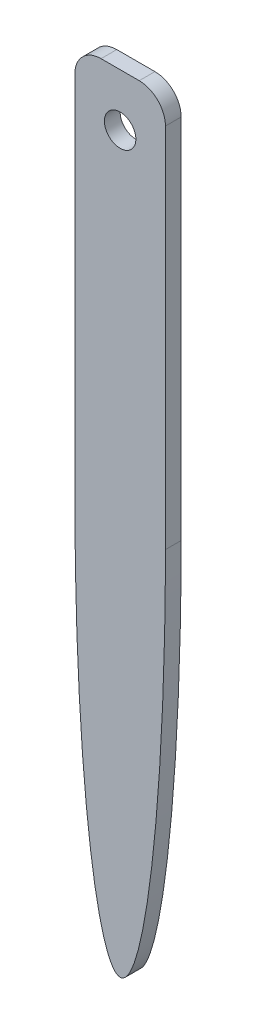
ISO-10303-21;
HEADER;
FILE_DESCRIPTION(('STEP AP214'),'2;1');
FILE_NAME('part.step','',(''),(''),'','','');
FILE_SCHEMA(('AUTOMOTIVE_DESIGN { 1 0 10303 214 1 1 1 1 }'));
ENDSEC;
DATA;
#1=APPLICATION_CONTEXT('core data for automotive mechanical design processes');
#2=APPLICATION_PROTOCOL_DEFINITION('international standard','automotive_design',2000,#1);
#3=PRODUCT_CONTEXT('',#1,'mechanical');
#4=PRODUCT('Part','Part','',(#3));
#5=PRODUCT_RELATED_PRODUCT_CATEGORY('part','',(#4));
#6=PRODUCT_DEFINITION_FORMATION('','',#4);
#7=PRODUCT_DEFINITION_CONTEXT('part definition',#1,'design');
#8=PRODUCT_DEFINITION('design','',#6,#7);
#9=PRODUCT_DEFINITION_SHAPE('','',#8);
#10=(LENGTH_UNIT() NAMED_UNIT(*) SI_UNIT(.MILLI.,.METRE.));
#11=(NAMED_UNIT(*) PLANE_ANGLE_UNIT() SI_UNIT($,.RADIAN.));
#12=(NAMED_UNIT(*) SI_UNIT($,.STERADIAN.) SOLID_ANGLE_UNIT());
#13=UNCERTAINTY_MEASURE_WITH_UNIT(LENGTH_MEASURE(1.E-05),#10,'distance_accuracy_value','');
#14=(GEOMETRIC_REPRESENTATION_CONTEXT(3) GLOBAL_UNCERTAINTY_ASSIGNED_CONTEXT((#13)) GLOBAL_UNIT_ASSIGNED_CONTEXT((#10,
#11,#12)) REPRESENTATION_CONTEXT('',''));
#15=CARTESIAN_POINT('',(0.,0.,0.));
#16=DIRECTION('',(0.,0.,1.));
#17=DIRECTION('',(1.,0.,0.));
#18=AXIS2_PLACEMENT_3D('',#15,#16,#17);
#19=CARTESIAN_POINT('',(0.,0.,3.));
#20=DIRECTION('',(0.,0.,1.));
#21=DIRECTION('',(1.,0.,0.));
#22=AXIS2_PLACEMENT_3D('',#19,#20,#21);
#23=PLANE('',#22);
#24=CARTESIAN_POINT('',(3.64166496588619,70.,3.));
#25=DIRECTION('',(0.,0.,1.));
#26=DIRECTION('',(-1.,0.,0.));
#27=AXIS2_PLACEMENT_3D('',#24,#25,#26);
#28=CIRCLE('',#27,5.);
#29=CARTESIAN_POINT('',(8.64166496588619,70.,3.));
#30=VERTEX_POINT('',#29);
#31=CARTESIAN_POINT('',(3.64166496588619,75.,3.));
#32=VERTEX_POINT('',#31);
#33=EDGE_CURVE('E181',#30,#32,#28,.T.);
#34=ORIENTED_EDGE('',*,*,#33,.T.);
#35=DIRECTION('',(-1.,0.,0.));
#36=VECTOR('',#35,1.);
#37=CARTESIAN_POINT('',(-3.64166496588621,75.,3.));
#38=LINE('',#37,#36);
#39=CARTESIAN_POINT('',(-3.64166496588621,75.,3.));
#40=VERTEX_POINT('',#39);
#41=EDGE_CURVE('E100',#32,#40,#38,.T.);
#42=ORIENTED_EDGE('',*,*,#41,.T.);
#43=CARTESIAN_POINT('',(-3.64166496588621,70.,3.));
#44=DIRECTION('',(0.,0.,1.));
#45=DIRECTION('',(1.,0.,0.));
#46=AXIS2_PLACEMENT_3D('',#43,#44,#45);
#47=CIRCLE('',#46,5.);
#48=CARTESIAN_POINT('',(-8.64166496588621,70.,3.));
#49=VERTEX_POINT('',#48);
#50=EDGE_CURVE('E113',#40,#49,#47,.T.);
#51=ORIENTED_EDGE('',*,*,#50,.T.);
#52=DIRECTION('',(0.,-1.,0.));
#53=VECTOR('',#52,1.);
#54=CARTESIAN_POINT('',(-8.64166496588621,70.,3.));
#55=LINE('',#54,#53);
#56=CARTESIAN_POINT('',(-8.6416649658862,0.,3.));
#57=VERTEX_POINT('',#56);
#58=EDGE_CURVE('E107',#49,#57,#55,.T.);
#59=ORIENTED_EDGE('',*,*,#58,.T.);
#60=CARTESIAN_POINT('',(0.,0.,3.));
#61=DIRECTION('',(0.,0.,1.));
#62=DIRECTION('',(0.,-1.,0.));
#63=AXIS2_PLACEMENT_3D('',#60,#61,#62);
#64=ELLIPSE('',#63,75.,8.6416649658862);
#65=CARTESIAN_POINT('',(8.6416649658862,0.,3.));
#66=VERTEX_POINT('',#65);
#67=EDGE_CURVE('E111',#57,#66,#64,.T.);
#68=ORIENTED_EDGE('',*,*,#67,.T.);
#69=DIRECTION('',(0.,1.,0.));
#70=VECTOR('',#69,1.);
#71=CARTESIAN_POINT('',(8.64166496588619,70.,3.));
#72=LINE('',#71,#70);
#73=EDGE_CURVE('E63',#66,#30,#72,.T.);
#74=ORIENTED_EDGE('',*,*,#73,.T.);
#75=EDGE_LOOP('',(#34,#42,#51,#59,#68,#74));
#76=FACE_BOUND('',#75,.T.);
#77=CARTESIAN_POINT('',(0.,65.,3.));
#78=DIRECTION('',(0.,0.,1.));
#79=DIRECTION('',(1.,0.,0.));
#80=AXIS2_PLACEMENT_3D('',#77,#78,#79);
#81=CIRCLE('',#80,3.);
#82=CARTESIAN_POINT('',(3.,65.,3.));
#83=VERTEX_POINT('',#82);
#84=EDGE_CURVE('E170',#83,#83,#81,.T.);
#85=ORIENTED_EDGE('',*,*,#84,.F.);
#86=EDGE_LOOP('',(#85));
#87=FACE_BOUND('',#86,.T.);
#88=ADVANCED_FACE('F45',(#76,#87),#23,.T.);
#89=CARTESIAN_POINT('',(0.,0.,0.));
#90=DIRECTION('',(0.,0.,1.));
#91=DIRECTION('',(1.,0.,0.));
#92=AXIS2_PLACEMENT_3D('',#89,#90,#91);
#93=PLANE('',#92);
#94=CARTESIAN_POINT('',(3.64166496588619,70.,0.));
#95=DIRECTION('',(0.,0.,1.));
#96=DIRECTION('',(-1.,0.,0.));
#97=AXIS2_PLACEMENT_3D('',#94,#95,#96);
#98=CIRCLE('',#97,5.);
#99=CARTESIAN_POINT('',(8.64166496588619,70.,0.));
#100=VERTEX_POINT('',#99);
#101=CARTESIAN_POINT('',(3.64166496588619,75.,0.));
#102=VERTEX_POINT('',#101);
#103=EDGE_CURVE('E178',#100,#102,#98,.T.);
#104=ORIENTED_EDGE('',*,*,#103,.F.);
#105=DIRECTION('',(0.,1.,0.));
#106=VECTOR('',#105,1.);
#107=CARTESIAN_POINT('',(8.64166496588619,70.,0.));
#108=LINE('',#107,#106);
#109=CARTESIAN_POINT('',(8.6416649658862,0.,0.));
#110=VERTEX_POINT('',#109);
#111=EDGE_CURVE('E92',#110,#100,#108,.T.);
#112=ORIENTED_EDGE('',*,*,#111,.F.);
#113=CARTESIAN_POINT('',(0.,0.,0.));
#114=DIRECTION('',(0.,0.,1.));
#115=DIRECTION('',(0.,-1.,0.));
#116=AXIS2_PLACEMENT_3D('',#113,#114,#115);
#117=ELLIPSE('',#116,75.,8.6416649658862);
#118=CARTESIAN_POINT('',(-8.6416649658862,0.,0.));
#119=VERTEX_POINT('',#118);
#120=EDGE_CURVE('E86',#119,#110,#117,.T.);
#121=ORIENTED_EDGE('',*,*,#120,.F.);
#122=DIRECTION('',(0.,-1.,0.));
#123=VECTOR('',#122,1.);
#124=CARTESIAN_POINT('',(-8.64166496588621,70.,0.));
#125=LINE('',#124,#123);
#126=CARTESIAN_POINT('',(-8.64166496588621,70.,0.));
#127=VERTEX_POINT('',#126);
#128=EDGE_CURVE('E122',#127,#119,#125,.T.);
#129=ORIENTED_EDGE('',*,*,#128,.F.);
#130=CARTESIAN_POINT('',(-3.64166496588621,70.,0.));
#131=DIRECTION('',(0.,0.,1.));
#132=DIRECTION('',(1.,0.,0.));
#133=AXIS2_PLACEMENT_3D('',#130,#131,#132);
#134=CIRCLE('',#133,5.);
#135=CARTESIAN_POINT('',(-3.64166496588621,75.,0.));
#136=VERTEX_POINT('',#135);
#137=EDGE_CURVE('E192',#136,#127,#134,.T.);
#138=ORIENTED_EDGE('',*,*,#137,.F.);
#139=DIRECTION('',(-1.,0.,0.));
#140=VECTOR('',#139,1.);
#141=CARTESIAN_POINT('',(-3.64166496588621,75.,0.));
#142=LINE('',#141,#140);
#143=EDGE_CURVE('E195',#102,#136,#142,.T.);
#144=ORIENTED_EDGE('',*,*,#143,.F.);
#145=EDGE_LOOP('',(#104,#112,#121,#129,#138,#144));
#146=FACE_BOUND('',#145,.T.);
#147=CARTESIAN_POINT('',(0.,65.,0.));
#148=DIRECTION('',(0.,0.,1.));
#149=DIRECTION('',(1.,0.,0.));
#150=AXIS2_PLACEMENT_3D('',#147,#148,#149);
#151=CIRCLE('',#150,3.);
#152=CARTESIAN_POINT('',(3.,65.,0.));
#153=VERTEX_POINT('',#152);
#154=EDGE_CURVE('E173',#153,#153,#151,.T.);
#155=ORIENTED_EDGE('',*,*,#154,.T.);
#156=EDGE_LOOP('',(#155));
#157=FACE_BOUND('',#156,.T.);
#158=ADVANCED_FACE('F152',(#146,#157),#93,.F.);
#159=CARTESIAN_POINT('',(3.64166496588619,70.,3.));
#160=DIRECTION('',(0.,0.,-1.));
#161=DIRECTION('',(-1.,0.,0.));
#162=AXIS2_PLACEMENT_3D('',#159,#160,#161);
#163=CYLINDRICAL_SURFACE('',#162,5.);
#164=ORIENTED_EDGE('',*,*,#103,.T.);
#165=DIRECTION('',(0.,0.,-1.));
#166=VECTOR('',#165,1.);
#167=CARTESIAN_POINT('',(3.64166496588619,75.,3.));
#168=LINE('',#167,#166);
#169=EDGE_CURVE('E11',#32,#102,#168,.T.);
#170=ORIENTED_EDGE('',*,*,#169,.F.);
#171=ORIENTED_EDGE('',*,*,#33,.F.);
#172=DIRECTION('',(0.,0.,-1.));
#173=VECTOR('',#172,1.);
#174=CARTESIAN_POINT('',(8.64166496588619,70.,3.));
#175=LINE('',#174,#173);
#176=EDGE_CURVE('E131',#30,#100,#175,.T.);
#177=ORIENTED_EDGE('',*,*,#176,.T.);
#178=EDGE_LOOP('',(#164,#170,#171,#177));
#179=FACE_BOUND('',#178,.T.);
#180=ADVANCED_FACE('F47',(#179),#163,.T.);
#181=CARTESIAN_POINT('',(-3.64166496588621,75.,3.));
#182=DIRECTION('',(0.,-1.,0.));
#183=DIRECTION('',(0.,0.,-1.));
#184=AXIS2_PLACEMENT_3D('',#181,#182,#183);
#185=PLANE('',#184);
#186=ORIENTED_EDGE('',*,*,#143,.T.);
#187=DIRECTION('',(0.,0.,-1.));
#188=VECTOR('',#187,1.);
#189=CARTESIAN_POINT('',(-3.64166496588621,75.,3.));
#190=LINE('',#189,#188);
#191=EDGE_CURVE('E55',#40,#136,#190,.T.);
#192=ORIENTED_EDGE('',*,*,#191,.F.);
#193=ORIENTED_EDGE('',*,*,#41,.F.);
#194=ORIENTED_EDGE('',*,*,#169,.T.);
#195=EDGE_LOOP('',(#186,#192,#193,#194));
#196=FACE_BOUND('',#195,.T.);
#197=ADVANCED_FACE('F146',(#196),#185,.F.);
#198=CARTESIAN_POINT('',(-3.64166496588621,70.,3.));
#199=DIRECTION('',(0.,0.,-1.));
#200=DIRECTION('',(-1.,0.,0.));
#201=AXIS2_PLACEMENT_3D('',#198,#199,#200);
#202=CYLINDRICAL_SURFACE('',#201,5.);
#203=ORIENTED_EDGE('',*,*,#137,.T.);
#204=DIRECTION('',(0.,0.,-1.));
#205=VECTOR('',#204,1.);
#206=CARTESIAN_POINT('',(-8.64166496588621,70.,3.));
#207=LINE('',#206,#205);
#208=EDGE_CURVE('E124',#49,#127,#207,.T.);
#209=ORIENTED_EDGE('',*,*,#208,.F.);
#210=ORIENTED_EDGE('',*,*,#50,.F.);
#211=ORIENTED_EDGE('',*,*,#191,.T.);
#212=EDGE_LOOP('',(#203,#209,#210,#211));
#213=FACE_BOUND('',#212,.T.);
#214=ADVANCED_FACE('F144',(#213),#202,.T.);
#215=CARTESIAN_POINT('',(-8.64166496588621,70.,3.));
#216=DIRECTION('',(1.,0.,0.));
#217=DIRECTION('',(0.,1.,0.));
#218=AXIS2_PLACEMENT_3D('',#215,#216,#217);
#219=PLANE('',#218);
#220=ORIENTED_EDGE('',*,*,#128,.T.);
#221=DIRECTION('',(0.,0.,-1.));
#222=VECTOR('',#221,1.);
#223=CARTESIAN_POINT('',(-8.6416649658862,0.,3.));
#224=LINE('',#223,#222);
#225=EDGE_CURVE('E119',#57,#119,#224,.T.);
#226=ORIENTED_EDGE('',*,*,#225,.F.);
#227=ORIENTED_EDGE('',*,*,#58,.F.);
#228=ORIENTED_EDGE('',*,*,#208,.T.);
#229=EDGE_LOOP('',(#220,#226,#227,#228));
#230=FACE_BOUND('',#229,.T.);
#231=ADVANCED_FACE('F120',(#230),#219,.F.);
#232=DIRECTION('',(0.,0.,-1.));
#233=VECTOR('',#232,1.);
#234=SURFACE_OF_LINEAR_EXTRUSION('',#64,#233);
#235=ORIENTED_EDGE('',*,*,#120,.T.);
#236=DIRECTION('',(0.,0.,-1.));
#237=VECTOR('',#236,1.);
#238=CARTESIAN_POINT('',(8.6416649658862,0.,3.));
#239=LINE('',#238,#237);
#240=EDGE_CURVE('E125',#66,#110,#239,.T.);
#241=ORIENTED_EDGE('',*,*,#240,.F.);
#242=ORIENTED_EDGE('',*,*,#67,.F.);
#243=ORIENTED_EDGE('',*,*,#225,.T.);
#244=EDGE_LOOP('',(#235,#241,#242,#243));
#245=FACE_BOUND('',#244,.T.);
#246=ADVANCED_FACE('F127',(#245),#234,.F.);
#247=CARTESIAN_POINT('',(8.64166496588619,70.,3.));
#248=DIRECTION('',(-1.,0.,0.));
#249=DIRECTION('',(0.,-1.,0.));
#250=AXIS2_PLACEMENT_3D('',#247,#248,#249);
#251=PLANE('',#250);
#252=ORIENTED_EDGE('',*,*,#111,.T.);
#253=ORIENTED_EDGE('',*,*,#176,.F.);
#254=ORIENTED_EDGE('',*,*,#73,.F.);
#255=ORIENTED_EDGE('',*,*,#240,.T.);
#256=EDGE_LOOP('',(#252,#253,#254,#255));
#257=FACE_BOUND('',#256,.T.);
#258=ADVANCED_FACE('F140',(#257),#251,.F.);
#259=CARTESIAN_POINT('',(0.,65.,3.));
#260=DIRECTION('',(0.,0.,-1.));
#261=DIRECTION('',(-1.,0.,0.));
#262=AXIS2_PLACEMENT_3D('',#259,#260,#261);
#263=CYLINDRICAL_SURFACE('',#262,3.);
#264=ORIENTED_EDGE('',*,*,#84,.T.);
#265=EDGE_LOOP('',(#264));
#266=FACE_BOUND('',#265,.T.);
#267=ORIENTED_EDGE('',*,*,#154,.F.);
#268=EDGE_LOOP('',(#267));
#269=FACE_BOUND('',#268,.T.);
#270=ADVANCED_FACE('F161',(#266,#269),#263,.F.);
#271=CLOSED_SHELL('',(#88,#158,#180,#197,#214,#231,#246,#258,#270));
#272=MANIFOLD_SOLID_BREP('B2',#271);
#273=ADVANCED_BREP_SHAPE_REPRESENTATION('',(#18,#272),#14);
#274=SHAPE_DEFINITION_REPRESENTATION(#9,#273);
ENDSEC;
END-ISO-10303-21;
